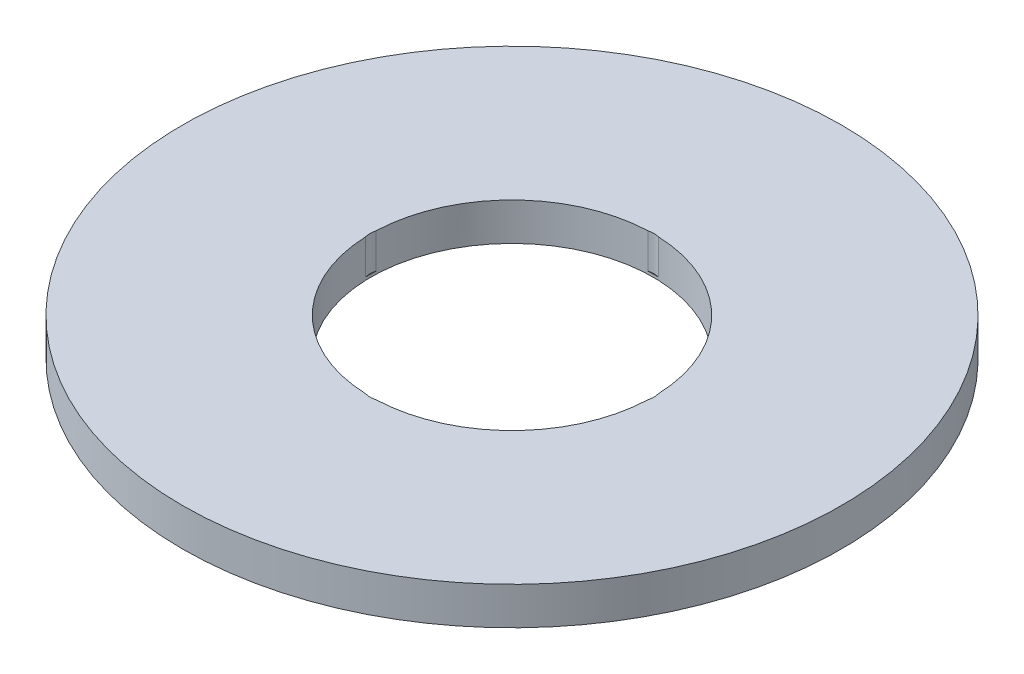
ISO-10303-21;
HEADER;
FILE_DESCRIPTION(('STEP AP214'),'2;1');
FILE_NAME('part.step','',(''),(''),'','','');
FILE_SCHEMA(('AUTOMOTIVE_DESIGN { 1 0 10303 214 1 1 1 1 }'));
ENDSEC;
DATA;
#1=APPLICATION_CONTEXT('core data for automotive mechanical design processes');
#2=APPLICATION_PROTOCOL_DEFINITION('international standard','automotive_design',2000,#1);
#3=PRODUCT_CONTEXT('',#1,'mechanical');
#4=PRODUCT('Part','Part','',(#3));
#5=PRODUCT_RELATED_PRODUCT_CATEGORY('part','',(#4));
#6=PRODUCT_DEFINITION_FORMATION('','',#4);
#7=PRODUCT_DEFINITION_CONTEXT('part definition',#1,'design');
#8=PRODUCT_DEFINITION('design','',#6,#7);
#9=PRODUCT_DEFINITION_SHAPE('','',#8);
#10=(LENGTH_UNIT() NAMED_UNIT(*) SI_UNIT(.MILLI.,.METRE.));
#11=(NAMED_UNIT(*) PLANE_ANGLE_UNIT() SI_UNIT($,.RADIAN.));
#12=(NAMED_UNIT(*) SI_UNIT($,.STERADIAN.) SOLID_ANGLE_UNIT());
#13=UNCERTAINTY_MEASURE_WITH_UNIT(LENGTH_MEASURE(1.E-05),#10,'distance_accuracy_value','');
#14=(GEOMETRIC_REPRESENTATION_CONTEXT(3) GLOBAL_UNCERTAINTY_ASSIGNED_CONTEXT((#13)) GLOBAL_UNIT_ASSIGNED_CONTEXT((#10,
#11,#12)) REPRESENTATION_CONTEXT('',''));
#15=CARTESIAN_POINT('',(0.,0.,0.));
#16=DIRECTION('',(0.,0.,1.));
#17=DIRECTION('',(1.,0.,0.));
#18=AXIS2_PLACEMENT_3D('',#15,#16,#17);
#19=CARTESIAN_POINT('',(0.,8.,0.));
#20=DIRECTION('',(0.,-1.,0.));
#21=DIRECTION('',(0.,0.,-1.));
#22=AXIS2_PLACEMENT_3D('',#19,#20,#21);
#23=CYLINDRICAL_SURFACE('',#22,70.);
#24=CARTESIAN_POINT('',(0.,8.,0.));
#25=DIRECTION('',(0.,1.,0.));
#26=DIRECTION('',(0.,0.,1.));
#27=AXIS2_PLACEMENT_3D('',#24,#25,#26);
#28=CIRCLE('',#27,70.);
#29=CARTESIAN_POINT('',(0.,8.,70.));
#30=VERTEX_POINT('',#29);
#31=EDGE_CURVE('E148',#30,#30,#28,.T.);
#32=ORIENTED_EDGE('',*,*,#31,.F.);
#33=EDGE_LOOP('',(#32));
#34=FACE_BOUND('',#33,.T.);
#35=CARTESIAN_POINT('',(0.,0.,0.));
#36=DIRECTION('',(0.,1.,0.));
#37=DIRECTION('',(0.,0.,1.));
#38=AXIS2_PLACEMENT_3D('',#35,#36,#37);
#39=CIRCLE('',#38,70.);
#40=CARTESIAN_POINT('',(0.,0.,70.));
#41=VERTEX_POINT('',#40);
#42=EDGE_CURVE('E139',#41,#41,#39,.T.);
#43=ORIENTED_EDGE('',*,*,#42,.T.);
#44=EDGE_LOOP('',(#43));
#45=FACE_BOUND('',#44,.T.);
#46=ADVANCED_FACE('F39',(#34,#45),#23,.T.);
#47=CARTESIAN_POINT('',(0.,8.,0.));
#48=DIRECTION('',(0.,1.,0.));
#49=DIRECTION('',(0.,0.,1.));
#50=AXIS2_PLACEMENT_3D('',#47,#48,#49);
#51=PLANE('',#50);
#52=CARTESIAN_POINT('',(0.,8.,26.0639191485331));
#53=DIRECTION('',(0.,1.,0.));
#54=DIRECTION('',(1.,0.,0.));
#55=AXIS2_PLACEMENT_3D('',#52,#53,#54);
#56=CIRCLE('',#55,4.0659505898562);
#57=CARTESIAN_POINT('',(-1.09350988729228,8.,29.9800639780237));
#58=VERTEX_POINT('',#57);
#59=CARTESIAN_POINT('',(1.09350988729249,8.,29.9800639780237));
#60=VERTEX_POINT('',#59);
#61=EDGE_CURVE('E175',#58,#60,#56,.T.);
#62=ORIENTED_EDGE('',*,*,#61,.F.);
#63=CARTESIAN_POINT('',(0.,8.,0.));
#64=DIRECTION('',(0.,1.,0.));
#65=DIRECTION('',(0.,0.,1.));
#66=AXIS2_PLACEMENT_3D('',#63,#64,#65);
#67=CIRCLE('',#66,30.);
#68=CARTESIAN_POINT('',(-29.9800639780237,8.,1.09350988729238));
#69=VERTEX_POINT('',#68);
#70=EDGE_CURVE('E134',#69,#58,#67,.T.);
#71=ORIENTED_EDGE('',*,*,#70,.F.);
#72=CARTESIAN_POINT('',(-26.0639191485331,8.,0.));
#73=DIRECTION('',(0.,1.,0.));
#74=DIRECTION('',(0.,0.,1.));
#75=AXIS2_PLACEMENT_3D('',#72,#73,#74);
#76=CIRCLE('',#75,4.0659505898562);
#77=CARTESIAN_POINT('',(-29.9800639780237,8.,-1.09350988729238));
#78=VERTEX_POINT('',#77);
#79=EDGE_CURVE('E143',#78,#69,#76,.T.);
#80=ORIENTED_EDGE('',*,*,#79,.F.);
#81=CARTESIAN_POINT('',(-1.0935098872927,8.,-29.9800639780237));
#82=VERTEX_POINT('',#81);
#83=EDGE_CURVE('E123',#82,#78,#67,.T.);
#84=ORIENTED_EDGE('',*,*,#83,.F.);
#85=CARTESIAN_POINT('',(-2.73005061972659E-13,8.,-26.0639191485331));
#86=DIRECTION('',(0.,1.,0.));
#87=DIRECTION('',(-1.,0.,0.));
#88=AXIS2_PLACEMENT_3D('',#85,#86,#87);
#89=CIRCLE('',#88,4.0659505898562);
#90=CARTESIAN_POINT('',(1.09350988729207,8.,-29.9800639780237));
#91=VERTEX_POINT('',#90);
#92=EDGE_CURVE('E106',#91,#82,#89,.T.);
#93=ORIENTED_EDGE('',*,*,#92,.F.);
#94=CARTESIAN_POINT('',(29.9800639780237,8.,-1.09350988729238));
#95=VERTEX_POINT('',#94);
#96=EDGE_CURVE('E125',#95,#91,#67,.T.);
#97=ORIENTED_EDGE('',*,*,#96,.F.);
#98=CARTESIAN_POINT('',(26.0639191485331,8.,0.));
#99=DIRECTION('',(0.,1.,0.));
#100=DIRECTION('',(0.,0.,-1.));
#101=AXIS2_PLACEMENT_3D('',#98,#99,#100);
#102=CIRCLE('',#101,4.0659505898562);
#103=CARTESIAN_POINT('',(29.9800639780237,8.,1.09350988729238));
#104=VERTEX_POINT('',#103);
#105=EDGE_CURVE('E286',#104,#95,#102,.T.);
#106=ORIENTED_EDGE('',*,*,#105,.F.);
#107=EDGE_CURVE('E135',#60,#104,#67,.T.);
#108=ORIENTED_EDGE('',*,*,#107,.F.);
#109=EDGE_LOOP('',(#62,#71,#80,#84,#93,#97,#106,#108));
#110=FACE_BOUND('',#109,.T.);
#111=ORIENTED_EDGE('',*,*,#31,.T.);
#112=EDGE_LOOP('',(#111));
#113=FACE_BOUND('',#112,.T.);
#114=ADVANCED_FACE('F118',(#110,#113),#51,.T.);
#115=CARTESIAN_POINT('',(0.,0.,0.));
#116=DIRECTION('',(0.,1.,0.));
#117=DIRECTION('',(0.,0.,1.));
#118=AXIS2_PLACEMENT_3D('',#115,#116,#117);
#119=PLANE('',#118);
#120=CARTESIAN_POINT('',(0.,0.,0.));
#121=DIRECTION('',(0.,1.,0.));
#122=DIRECTION('',(0.,0.,1.));
#123=AXIS2_PLACEMENT_3D('',#120,#121,#122);
#124=CIRCLE('',#123,30.);
#125=CARTESIAN_POINT('',(0.,0.,30.));
#126=VERTEX_POINT('',#125);
#127=EDGE_CURVE('E136',#126,#126,#124,.T.);
#128=ORIENTED_EDGE('',*,*,#127,.T.);
#129=EDGE_LOOP('',(#128));
#130=FACE_BOUND('',#129,.T.);
#131=ORIENTED_EDGE('',*,*,#42,.F.);
#132=EDGE_LOOP('',(#131));
#133=FACE_BOUND('',#132,.T.);
#134=ADVANCED_FACE('F187',(#130,#133),#119,.F.);
#135=CARTESIAN_POINT('',(0.,8.,0.));
#136=DIRECTION('',(0.,-1.,0.));
#137=DIRECTION('',(0.,0.,-1.));
#138=AXIS2_PLACEMENT_3D('',#135,#136,#137);
#139=CYLINDRICAL_SURFACE('',#138,30.);
#140=DIRECTION('',(0.,1.,0.));
#141=VECTOR('',#140,1.);
#142=CARTESIAN_POINT('',(-1.0935098872923,4.28995885658127,29.9800639780237));
#143=LINE('',#142,#141);
#144=CARTESIAN_POINT('',(-1.09350988729228,0.579917713162537,29.9800639780237));
#145=VERTEX_POINT('',#144);
#146=EDGE_CURVE('E11',#145,#58,#143,.T.);
#147=ORIENTED_EDGE('',*,*,#146,.F.);
#148=CARTESIAN_POINT('',(0.,0.579917713162537,0.));
#149=DIRECTION('',(0.,1.,0.));
#150=DIRECTION('',(0.,0.,1.));
#151=AXIS2_PLACEMENT_3D('',#148,#149,#150);
#152=CIRCLE('',#151,30.);
#153=CARTESIAN_POINT('',(1.09350988729249,0.579917713162537,29.9800639780237));
#154=VERTEX_POINT('',#153);
#155=EDGE_CURVE('E170',#145,#154,#152,.T.);
#156=ORIENTED_EDGE('',*,*,#155,.T.);
#157=DIRECTION('',(0.,1.,0.));
#158=VECTOR('',#157,1.);
#159=CARTESIAN_POINT('',(1.09350988729251,4.28995885658127,29.9800639780237));
#160=LINE('',#159,#158);
#161=EDGE_CURVE('E46',#60,#154,#160,.F.);
#162=ORIENTED_EDGE('',*,*,#161,.F.);
#163=ORIENTED_EDGE('',*,*,#107,.T.);
#164=DIRECTION('',(0.,1.,0.));
#165=VECTOR('',#164,1.);
#166=CARTESIAN_POINT('',(29.9800639780237,4.28995885658127,1.0935098872924));
#167=LINE('',#166,#165);
#168=CARTESIAN_POINT('',(29.9800639780237,0.579917713162537,1.09350988729238));
#169=VERTEX_POINT('',#168);
#170=EDGE_CURVE('E164',#169,#104,#167,.T.);
#171=ORIENTED_EDGE('',*,*,#170,.F.);
#172=CARTESIAN_POINT('',(0.,0.579917713162537,0.));
#173=DIRECTION('',(0.,1.,0.));
#174=DIRECTION('',(0.,0.,1.));
#175=AXIS2_PLACEMENT_3D('',#172,#173,#174);
#176=CIRCLE('',#175,30.);
#177=CARTESIAN_POINT('',(29.9800639780237,0.579917713162537,-1.09350988729238));
#178=VERTEX_POINT('',#177);
#179=EDGE_CURVE('E115',#169,#178,#176,.T.);
#180=ORIENTED_EDGE('',*,*,#179,.T.);
#181=DIRECTION('',(0.,1.,0.));
#182=VECTOR('',#181,1.);
#183=CARTESIAN_POINT('',(29.9800639780237,4.28995885658127,-1.0935098872924));
#184=LINE('',#183,#182);
#185=EDGE_CURVE('E131',#95,#178,#184,.F.);
#186=ORIENTED_EDGE('',*,*,#185,.F.);
#187=ORIENTED_EDGE('',*,*,#96,.T.);
#188=DIRECTION('',(0.,1.,0.));
#189=VECTOR('',#188,1.);
#190=CARTESIAN_POINT('',(1.09350988729209,4.28995885658127,-29.9800639780237));
#191=LINE('',#190,#189);
#192=CARTESIAN_POINT('',(1.09350988729207,0.579917713162537,-29.9800639780237));
#193=VERTEX_POINT('',#192);
#194=EDGE_CURVE('E105',#193,#91,#191,.T.);
#195=ORIENTED_EDGE('',*,*,#194,.F.);
#196=CARTESIAN_POINT('',(0.,0.579917713162537,0.));
#197=DIRECTION('',(0.,1.,0.));
#198=DIRECTION('',(0.,0.,1.));
#199=AXIS2_PLACEMENT_3D('',#196,#197,#198);
#200=CIRCLE('',#199,30.);
#201=CARTESIAN_POINT('',(-1.0935098872927,0.579917713162537,-29.9800639780237));
#202=VERTEX_POINT('',#201);
#203=EDGE_CURVE('E159',#193,#202,#200,.T.);
#204=ORIENTED_EDGE('',*,*,#203,.T.);
#205=DIRECTION('',(0.,1.,0.));
#206=VECTOR('',#205,1.);
#207=CARTESIAN_POINT('',(-1.09350988729272,4.28995885658127,-29.9800639780237));
#208=LINE('',#207,#206);
#209=EDGE_CURVE('E114',#82,#202,#208,.F.);
#210=ORIENTED_EDGE('',*,*,#209,.F.);
#211=ORIENTED_EDGE('',*,*,#83,.T.);
#212=DIRECTION('',(0.,1.,0.));
#213=VECTOR('',#212,1.);
#214=CARTESIAN_POINT('',(-29.9800639780237,4.28995885658127,-1.0935098872924));
#215=LINE('',#214,#213);
#216=CARTESIAN_POINT('',(-29.9800639780237,0.579917713162537,-1.09350988729238));
#217=VERTEX_POINT('',#216);
#218=EDGE_CURVE('E160',#217,#78,#215,.T.);
#219=ORIENTED_EDGE('',*,*,#218,.F.);
#220=CARTESIAN_POINT('',(0.,0.579917713162537,0.));
#221=DIRECTION('',(0.,1.,0.));
#222=DIRECTION('',(0.,0.,1.));
#223=AXIS2_PLACEMENT_3D('',#220,#221,#222);
#224=CIRCLE('',#223,30.);
#225=CARTESIAN_POINT('',(-29.9800639780237,0.579917713162537,1.09350988729238));
#226=VERTEX_POINT('',#225);
#227=EDGE_CURVE('E149',#217,#226,#224,.T.);
#228=ORIENTED_EDGE('',*,*,#227,.T.);
#229=DIRECTION('',(0.,1.,0.));
#230=VECTOR('',#229,1.);
#231=CARTESIAN_POINT('',(-29.9800639780237,4.28995885658127,1.0935098872924));
#232=LINE('',#231,#230);
#233=EDGE_CURVE('E152',#69,#226,#232,.F.);
#234=ORIENTED_EDGE('',*,*,#233,.F.);
#235=ORIENTED_EDGE('',*,*,#70,.T.);
#236=EDGE_LOOP('',(#147,#156,#162,#163,#171,#180,#186,#187,#195,#204,#210,#211,#219,#228,#234,#235));
#237=FACE_BOUND('',#236,.T.);
#238=ORIENTED_EDGE('',*,*,#127,.F.);
#239=EDGE_LOOP('',(#238));
#240=FACE_BOUND('',#239,.T.);
#241=ADVANCED_FACE('F126',(#237,#240),#139,.F.);
#242=CARTESIAN_POINT('',(-26.0639191485331,0.579917713162537,0.));
#243=DIRECTION('',(0.,1.,0.));
#244=DIRECTION('',(0.,0.,1.));
#245=AXIS2_PLACEMENT_3D('',#242,#243,#244);
#246=CYLINDRICAL_SURFACE('',#245,4.0659505898562);
#247=ORIENTED_EDGE('',*,*,#218,.T.);
#248=ORIENTED_EDGE('',*,*,#79,.T.);
#249=ORIENTED_EDGE('',*,*,#233,.T.);
#250=CARTESIAN_POINT('',(-26.0639191485331,0.579917713162537,0.));
#251=DIRECTION('',(0.,1.,0.));
#252=DIRECTION('',(0.,0.,1.));
#253=AXIS2_PLACEMENT_3D('',#250,#251,#252);
#254=CIRCLE('',#253,4.0659505898562);
#255=EDGE_CURVE('E144',#217,#226,#254,.T.);
#256=ORIENTED_EDGE('',*,*,#255,.F.);
#257=EDGE_LOOP('',(#247,#248,#249,#256));
#258=FACE_BOUND('',#257,.T.);
#259=ADVANCED_FACE('F200',(#258),#246,.F.);
#260=CARTESIAN_POINT('',(-26.0639191485331,0.579917713162537,0.));
#261=DIRECTION('',(0.,1.,0.));
#262=DIRECTION('',(0.,0.,1.));
#263=AXIS2_PLACEMENT_3D('',#260,#261,#262);
#264=PLANE('',#263);
#265=ORIENTED_EDGE('',*,*,#255,.T.);
#266=ORIENTED_EDGE('',*,*,#227,.F.);
#267=EDGE_LOOP('',(#265,#266));
#268=FACE_BOUND('',#267,.T.);
#269=ADVANCED_FACE('F201',(#268),#264,.T.);
#270=CARTESIAN_POINT('',(-2.73005061972659E-13,0.579917713162537,-26.0639191485331));
#271=DIRECTION('',(0.,1.,0.));
#272=DIRECTION('',(0.,0.,1.));
#273=AXIS2_PLACEMENT_3D('',#270,#271,#272);
#274=CYLINDRICAL_SURFACE('',#273,4.0659505898562);
#275=ORIENTED_EDGE('',*,*,#194,.T.);
#276=ORIENTED_EDGE('',*,*,#92,.T.);
#277=ORIENTED_EDGE('',*,*,#209,.T.);
#278=CARTESIAN_POINT('',(-2.73005061972659E-13,0.579917713162537,-26.0639191485331));
#279=DIRECTION('',(0.,1.,0.));
#280=DIRECTION('',(-1.,0.,0.));
#281=AXIS2_PLACEMENT_3D('',#278,#279,#280);
#282=CIRCLE('',#281,4.0659505898562);
#283=EDGE_CURVE('E107',#193,#202,#282,.T.);
#284=ORIENTED_EDGE('',*,*,#283,.F.);
#285=EDGE_LOOP('',(#275,#276,#277,#284));
#286=FACE_BOUND('',#285,.T.);
#287=ADVANCED_FACE('F102',(#286),#274,.F.);
#288=CARTESIAN_POINT('',(-2.73005061972659E-13,0.579917713162537,-26.0639191485331));
#289=DIRECTION('',(0.,1.,0.));
#290=DIRECTION('',(-1.,0.,0.));
#291=AXIS2_PLACEMENT_3D('',#288,#289,#290);
#292=PLANE('',#291);
#293=ORIENTED_EDGE('',*,*,#283,.T.);
#294=ORIENTED_EDGE('',*,*,#203,.F.);
#295=EDGE_LOOP('',(#293,#294));
#296=FACE_BOUND('',#295,.T.);
#297=ADVANCED_FACE('F209',(#296),#292,.T.);
#298=CARTESIAN_POINT('',(26.0639191485331,0.579917713162537,0.));
#299=DIRECTION('',(0.,1.,0.));
#300=DIRECTION('',(0.,0.,1.));
#301=AXIS2_PLACEMENT_3D('',#298,#299,#300);
#302=CYLINDRICAL_SURFACE('',#301,4.0659505898562);
#303=ORIENTED_EDGE('',*,*,#170,.T.);
#304=ORIENTED_EDGE('',*,*,#105,.T.);
#305=ORIENTED_EDGE('',*,*,#185,.T.);
#306=CARTESIAN_POINT('',(26.0639191485331,0.579917713162537,0.));
#307=DIRECTION('',(0.,1.,0.));
#308=DIRECTION('',(0.,0.,-1.));
#309=AXIS2_PLACEMENT_3D('',#306,#307,#308);
#310=CIRCLE('',#309,4.0659505898562);
#311=EDGE_CURVE('E56',#169,#178,#310,.T.);
#312=ORIENTED_EDGE('',*,*,#311,.F.);
#313=EDGE_LOOP('',(#303,#304,#305,#312));
#314=FACE_BOUND('',#313,.T.);
#315=ADVANCED_FACE('F213',(#314),#302,.F.);
#316=CARTESIAN_POINT('',(26.0639191485331,0.579917713162537,0.));
#317=DIRECTION('',(0.,1.,0.));
#318=DIRECTION('',(0.,0.,-1.));
#319=AXIS2_PLACEMENT_3D('',#316,#317,#318);
#320=PLANE('',#319);
#321=ORIENTED_EDGE('',*,*,#311,.T.);
#322=ORIENTED_EDGE('',*,*,#179,.F.);
#323=EDGE_LOOP('',(#321,#322));
#324=FACE_BOUND('',#323,.T.);
#325=ADVANCED_FACE('F179',(#324),#320,.T.);
#326=CARTESIAN_POINT('',(0.,0.579917713162537,26.0639191485331));
#327=DIRECTION('',(0.,1.,0.));
#328=DIRECTION('',(0.,0.,1.));
#329=AXIS2_PLACEMENT_3D('',#326,#327,#328);
#330=CYLINDRICAL_SURFACE('',#329,4.0659505898562);
#331=ORIENTED_EDGE('',*,*,#146,.T.);
#332=ORIENTED_EDGE('',*,*,#61,.T.);
#333=ORIENTED_EDGE('',*,*,#161,.T.);
#334=CARTESIAN_POINT('',(0.,0.579917713162537,26.0639191485331));
#335=DIRECTION('',(0.,1.,0.));
#336=DIRECTION('',(1.,0.,0.));
#337=AXIS2_PLACEMENT_3D('',#334,#335,#336);
#338=CIRCLE('',#337,4.0659505898562);
#339=EDGE_CURVE('E55',#145,#154,#338,.T.);
#340=ORIENTED_EDGE('',*,*,#339,.F.);
#341=EDGE_LOOP('',(#331,#332,#333,#340));
#342=FACE_BOUND('',#341,.T.);
#343=ADVANCED_FACE('F171',(#342),#330,.F.);
#344=CARTESIAN_POINT('',(0.,0.579917713162537,26.0639191485331));
#345=DIRECTION('',(0.,1.,0.));
#346=DIRECTION('',(1.,0.,0.));
#347=AXIS2_PLACEMENT_3D('',#344,#345,#346);
#348=PLANE('',#347);
#349=ORIENTED_EDGE('',*,*,#339,.T.);
#350=ORIENTED_EDGE('',*,*,#155,.F.);
#351=EDGE_LOOP('',(#349,#350));
#352=FACE_BOUND('',#351,.T.);
#353=ADVANCED_FACE('F173',(#352),#348,.T.);
#354=CLOSED_SHELL('',(#46,#114,#134,#241,#259,#269,#287,#297,#315,#325,#343,#353));
#355=MANIFOLD_SOLID_BREP('B2',#354);
#356=ADVANCED_BREP_SHAPE_REPRESENTATION('',(#18,#355),#14);
#357=SHAPE_DEFINITION_REPRESENTATION(#9,#356);
ENDSEC;
END-ISO-10303-21;
